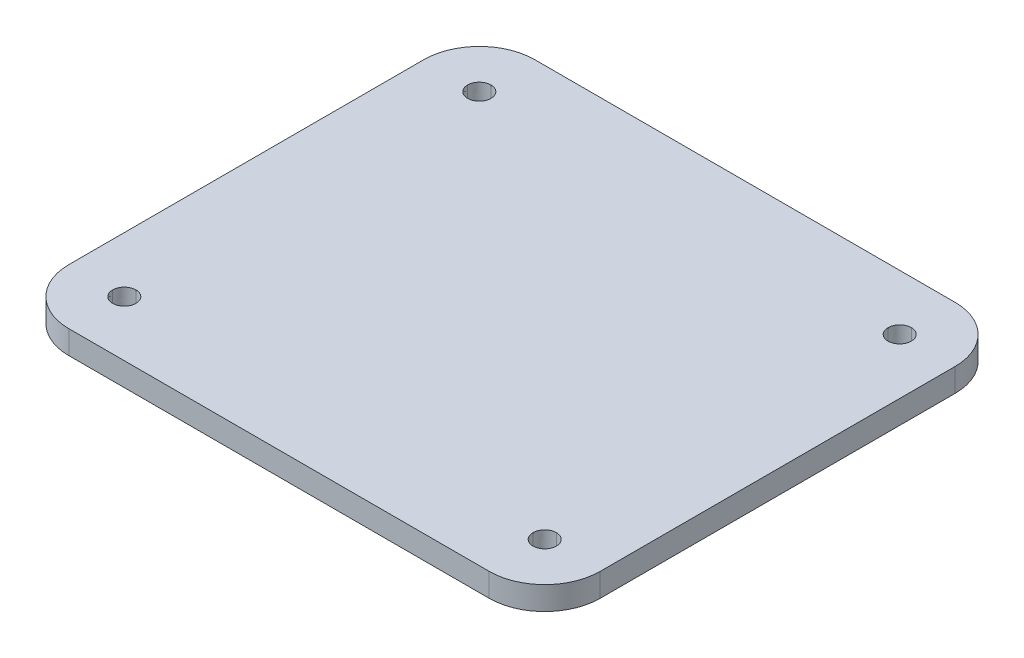
ISO-10303-21;
HEADER;
FILE_DESCRIPTION(('STEP AP214'),'2;1');
FILE_NAME('part.step','',(''),(''),'','','');
FILE_SCHEMA(('AUTOMOTIVE_DESIGN { 1 0 10303 214 1 1 1 1 }'));
ENDSEC;
DATA;
#1=APPLICATION_CONTEXT('core data for automotive mechanical design processes');
#2=APPLICATION_PROTOCOL_DEFINITION('international standard','automotive_design',2000,#1);
#3=PRODUCT_CONTEXT('',#1,'mechanical');
#4=PRODUCT('Part','Part','',(#3));
#5=PRODUCT_RELATED_PRODUCT_CATEGORY('part','',(#4));
#6=PRODUCT_DEFINITION_FORMATION('','',#4);
#7=PRODUCT_DEFINITION_CONTEXT('part definition',#1,'design');
#8=PRODUCT_DEFINITION('design','',#6,#7);
#9=PRODUCT_DEFINITION_SHAPE('','',#8);
#10=(LENGTH_UNIT() NAMED_UNIT(*) SI_UNIT(.MILLI.,.METRE.));
#11=(NAMED_UNIT(*) PLANE_ANGLE_UNIT() SI_UNIT($,.RADIAN.));
#12=(NAMED_UNIT(*) SI_UNIT($,.STERADIAN.) SOLID_ANGLE_UNIT());
#13=UNCERTAINTY_MEASURE_WITH_UNIT(LENGTH_MEASURE(1.E-05),#10,'distance_accuracy_value','');
#14=(GEOMETRIC_REPRESENTATION_CONTEXT(3) GLOBAL_UNCERTAINTY_ASSIGNED_CONTEXT((#13)) GLOBAL_UNIT_ASSIGNED_CONTEXT((#10,
#11,#12)) REPRESENTATION_CONTEXT('',''));
#15=CARTESIAN_POINT('',(0.,0.,0.));
#16=DIRECTION('',(0.,0.,1.));
#17=DIRECTION('',(1.,0.,0.));
#18=AXIS2_PLACEMENT_3D('',#15,#16,#17);
#19=CARTESIAN_POINT('',(-92.0838,3.175,-79.8373));
#20=DIRECTION('',(0.,-1.,0.));
#21=DIRECTION('',(0.,0.,-1.));
#22=AXIS2_PLACEMENT_3D('',#19,#20,#21);
#23=CYLINDRICAL_SURFACE('',#22,7.54000000000001);
#24=CARTESIAN_POINT('',(-92.0838,0.,-79.8373));
#25=DIRECTION('',(0.,1.,0.));
#26=DIRECTION('',(0.,0.,1.));
#27=AXIS2_PLACEMENT_3D('',#24,#25,#26);
#28=CIRCLE('',#27,7.54000000000001);
#29=CARTESIAN_POINT('',(-92.0837999999999,0.,-72.2973));
#30=VERTEX_POINT('',#29);
#31=CARTESIAN_POINT('',(-99.6238,0.,-79.8373000000001));
#32=VERTEX_POINT('',#31);
#33=EDGE_CURVE('E356',#30,#32,#28,.F.);
#34=ORIENTED_EDGE('',*,*,#33,.F.);
#35=DIRECTION('',(0.,-1.,0.));
#36=VECTOR('',#35,1.);
#37=CARTESIAN_POINT('',(-92.0837999999999,3.175,-72.2973));
#38=LINE('',#37,#36);
#39=CARTESIAN_POINT('',(-92.0837999999999,3.175,-72.2973));
#40=VERTEX_POINT('',#39);
#41=EDGE_CURVE('E11',#40,#30,#38,.T.);
#42=ORIENTED_EDGE('',*,*,#41,.F.);
#43=CARTESIAN_POINT('',(-92.0838,3.175,-79.8373));
#44=DIRECTION('',(0.,1.,0.));
#45=DIRECTION('',(0.,0.,1.));
#46=AXIS2_PLACEMENT_3D('',#43,#44,#45);
#47=CIRCLE('',#46,7.54000000000001);
#48=CARTESIAN_POINT('',(-99.6238,3.175,-79.8373000000001));
#49=VERTEX_POINT('',#48);
#50=EDGE_CURVE('E512',#40,#49,#47,.F.);
#51=ORIENTED_EDGE('',*,*,#50,.T.);
#52=DIRECTION('',(0.,-1.,0.));
#53=VECTOR('',#52,1.);
#54=CARTESIAN_POINT('',(-99.6238,3.175,-79.8373000000001));
#55=LINE('',#54,#53);
#56=EDGE_CURVE('E54',#49,#32,#55,.T.);
#57=ORIENTED_EDGE('',*,*,#56,.T.);
#58=EDGE_LOOP('',(#34,#42,#51,#57));
#59=FACE_BOUND('',#58,.T.);
#60=ADVANCED_FACE('F34',(#59),#23,.T.);
#61=CARTESIAN_POINT('',(0.,3.175,-72.2973));
#62=DIRECTION('',(0.,0.,-1.));
#63=DIRECTION('',(-1.,0.,0.));
#64=AXIS2_PLACEMENT_3D('',#61,#62,#63);
#65=PLANE('',#64);
#66=DIRECTION('',(1.,0.,0.));
#67=VECTOR('',#66,1.);
#68=CARTESIAN_POINT('',(0.,0.,-72.2973));
#69=LINE('',#68,#67);
#70=CARTESIAN_POINT('',(-34.9338,0.,-72.2973));
#71=VERTEX_POINT('',#70);
#72=EDGE_CURVE('E361',#30,#71,#69,.T.);
#73=ORIENTED_EDGE('',*,*,#72,.T.);
#74=DIRECTION('',(0.,-1.,0.));
#75=VECTOR('',#74,1.);
#76=CARTESIAN_POINT('',(-34.9338,3.175,-72.2973));
#77=LINE('',#76,#75);
#78=CARTESIAN_POINT('',(-34.9338,3.175,-72.2973));
#79=VERTEX_POINT('',#78);
#80=EDGE_CURVE('E45',#79,#71,#77,.T.);
#81=ORIENTED_EDGE('',*,*,#80,.F.);
#82=DIRECTION('',(1.,0.,0.));
#83=VECTOR('',#82,1.);
#84=CARTESIAN_POINT('',(0.,3.175,-72.2973));
#85=LINE('',#84,#83);
#86=EDGE_CURVE('E522',#40,#79,#85,.T.);
#87=ORIENTED_EDGE('',*,*,#86,.F.);
#88=ORIENTED_EDGE('',*,*,#41,.T.);
#89=EDGE_LOOP('',(#73,#81,#87,#88));
#90=FACE_BOUND('',#89,.T.);
#91=ADVANCED_FACE('F488',(#90),#65,.F.);
#92=CARTESIAN_POINT('',(-34.9338,3.175,-79.8373));
#93=DIRECTION('',(0.,-1.,0.));
#94=DIRECTION('',(0.,0.,-1.));
#95=AXIS2_PLACEMENT_3D('',#92,#93,#94);
#96=CYLINDRICAL_SURFACE('',#95,7.54);
#97=CARTESIAN_POINT('',(-34.9338,0.,-79.8373));
#98=DIRECTION('',(0.,1.,0.));
#99=DIRECTION('',(0.,0.,1.));
#100=AXIS2_PLACEMENT_3D('',#97,#98,#99);
#101=CIRCLE('',#100,7.54);
#102=CARTESIAN_POINT('',(-27.3938,0.,-79.8373000000001));
#103=VERTEX_POINT('',#102);
#104=EDGE_CURVE('E364',#71,#103,#101,.T.);
#105=ORIENTED_EDGE('',*,*,#104,.T.);
#106=DIRECTION('',(0.,-1.,0.));
#107=VECTOR('',#106,1.);
#108=CARTESIAN_POINT('',(-27.3938,3.175,-79.8373000000001));
#109=LINE('',#108,#107);
#110=CARTESIAN_POINT('',(-27.3938,3.175,-79.8373000000001));
#111=VERTEX_POINT('',#110);
#112=EDGE_CURVE('E386',#111,#103,#109,.T.);
#113=ORIENTED_EDGE('',*,*,#112,.F.);
#114=CARTESIAN_POINT('',(-34.9338,3.175,-79.8373));
#115=DIRECTION('',(0.,1.,0.));
#116=DIRECTION('',(0.,0.,1.));
#117=AXIS2_PLACEMENT_3D('',#114,#115,#116);
#118=CIRCLE('',#117,7.54);
#119=EDGE_CURVE('E525',#79,#111,#118,.T.);
#120=ORIENTED_EDGE('',*,*,#119,.F.);
#121=ORIENTED_EDGE('',*,*,#80,.T.);
#122=EDGE_LOOP('',(#105,#113,#120,#121));
#123=FACE_BOUND('',#122,.T.);
#124=ADVANCED_FACE('F493',(#123),#96,.T.);
#125=CARTESIAN_POINT('',(-27.3937999999999,3.175,0.));
#126=DIRECTION('',(-1.,0.,0.));
#127=DIRECTION('',(0.,0.,1.));
#128=AXIS2_PLACEMENT_3D('',#125,#126,#127);
#129=PLANE('',#128);
#130=DIRECTION('',(0.,0.,-1.));
#131=VECTOR('',#130,1.);
#132=CARTESIAN_POINT('',(-27.3937999999999,0.,0.));
#133=LINE('',#132,#131);
#134=CARTESIAN_POINT('',(-27.3938,0.,-128.0973));
#135=VERTEX_POINT('',#134);
#136=EDGE_CURVE('E367',#103,#135,#133,.T.);
#137=ORIENTED_EDGE('',*,*,#136,.T.);
#138=DIRECTION('',(0.,-1.,0.));
#139=VECTOR('',#138,1.);
#140=CARTESIAN_POINT('',(-27.3938,3.175,-128.0973));
#141=LINE('',#140,#139);
#142=CARTESIAN_POINT('',(-27.3938,3.175,-128.0973));
#143=VERTEX_POINT('',#142);
#144=EDGE_CURVE('E384',#143,#135,#141,.T.);
#145=ORIENTED_EDGE('',*,*,#144,.F.);
#146=DIRECTION('',(0.,0.,-1.));
#147=VECTOR('',#146,1.);
#148=CARTESIAN_POINT('',(-27.3937999999999,3.175,0.));
#149=LINE('',#148,#147);
#150=EDGE_CURVE('E528',#111,#143,#149,.T.);
#151=ORIENTED_EDGE('',*,*,#150,.F.);
#152=ORIENTED_EDGE('',*,*,#112,.T.);
#153=EDGE_LOOP('',(#137,#145,#151,#152));
#154=FACE_BOUND('',#153,.T.);
#155=ADVANCED_FACE('F550',(#154),#129,.F.);
#156=CARTESIAN_POINT('',(-34.9338,3.175,-128.0973));
#157=DIRECTION('',(0.,-1.,0.));
#158=DIRECTION('',(0.,0.,-1.));
#159=AXIS2_PLACEMENT_3D('',#156,#157,#158);
#160=CYLINDRICAL_SURFACE('',#159,7.53999999999999);
#161=CARTESIAN_POINT('',(-34.9338,0.,-128.0973));
#162=DIRECTION('',(0.,1.,0.));
#163=DIRECTION('',(0.,0.,1.));
#164=AXIS2_PLACEMENT_3D('',#161,#162,#163);
#165=CIRCLE('',#164,7.53999999999999);
#166=CARTESIAN_POINT('',(-34.9338,0.,-135.6373));
#167=VERTEX_POINT('',#166);
#168=EDGE_CURVE('E370',#167,#135,#165,.F.);
#169=ORIENTED_EDGE('',*,*,#168,.F.);
#170=DIRECTION('',(0.,-1.,0.));
#171=VECTOR('',#170,1.);
#172=CARTESIAN_POINT('',(-34.9338,3.175,-135.6373));
#173=LINE('',#172,#171);
#174=CARTESIAN_POINT('',(-34.9338,3.175,-135.6373));
#175=VERTEX_POINT('',#174);
#176=EDGE_CURVE('E212',#175,#167,#173,.T.);
#177=ORIENTED_EDGE('',*,*,#176,.F.);
#178=CARTESIAN_POINT('',(-34.9338,3.175,-128.0973));
#179=DIRECTION('',(0.,1.,0.));
#180=DIRECTION('',(0.,0.,1.));
#181=AXIS2_PLACEMENT_3D('',#178,#179,#180);
#182=CIRCLE('',#181,7.53999999999999);
#183=EDGE_CURVE('E222',#175,#143,#182,.F.);
#184=ORIENTED_EDGE('',*,*,#183,.T.);
#185=ORIENTED_EDGE('',*,*,#144,.T.);
#186=EDGE_LOOP('',(#169,#177,#184,#185));
#187=FACE_BOUND('',#186,.T.);
#188=ADVANCED_FACE('F531',(#187),#160,.T.);
#189=CARTESIAN_POINT('',(0.,3.175,-135.6373));
#190=DIRECTION('',(0.,0.,-1.));
#191=DIRECTION('',(-1.,0.,0.));
#192=AXIS2_PLACEMENT_3D('',#189,#190,#191);
#193=PLANE('',#192);
#194=DIRECTION('',(1.,0.,0.));
#195=VECTOR('',#194,1.);
#196=CARTESIAN_POINT('',(0.,0.,-135.6373));
#197=LINE('',#196,#195);
#198=CARTESIAN_POINT('',(-92.0838,0.,-135.6373));
#199=VERTEX_POINT('',#198);
#200=EDGE_CURVE('E208',#199,#167,#197,.T.);
#201=ORIENTED_EDGE('',*,*,#200,.F.);
#202=DIRECTION('',(0.,-1.,0.));
#203=VECTOR('',#202,1.);
#204=CARTESIAN_POINT('',(-92.0838,3.175,-135.6373));
#205=LINE('',#204,#203);
#206=CARTESIAN_POINT('',(-92.0838,3.175,-135.6373));
#207=VERTEX_POINT('',#206);
#208=EDGE_CURVE('E203',#207,#199,#205,.T.);
#209=ORIENTED_EDGE('',*,*,#208,.F.);
#210=DIRECTION('',(1.,0.,0.));
#211=VECTOR('',#210,1.);
#212=CARTESIAN_POINT('',(0.,3.175,-135.6373));
#213=LINE('',#212,#211);
#214=EDGE_CURVE('E206',#207,#175,#213,.T.);
#215=ORIENTED_EDGE('',*,*,#214,.T.);
#216=ORIENTED_EDGE('',*,*,#176,.T.);
#217=EDGE_LOOP('',(#201,#209,#215,#216));
#218=FACE_BOUND('',#217,.T.);
#219=ADVANCED_FACE('F205',(#218),#193,.T.);
#220=CARTESIAN_POINT('',(-92.0838,3.175,-128.0973));
#221=DIRECTION('',(0.,-1.,0.));
#222=DIRECTION('',(0.,0.,-1.));
#223=AXIS2_PLACEMENT_3D('',#220,#221,#222);
#224=CYLINDRICAL_SURFACE('',#223,7.54);
#225=CARTESIAN_POINT('',(-92.0838,0.,-128.0973));
#226=DIRECTION('',(0.,1.,0.));
#227=DIRECTION('',(0.,0.,1.));
#228=AXIS2_PLACEMENT_3D('',#225,#226,#227);
#229=CIRCLE('',#228,7.54);
#230=CARTESIAN_POINT('',(-99.6238,0.,-128.0973));
#231=VERTEX_POINT('',#230);
#232=EDGE_CURVE('E374',#231,#199,#229,.F.);
#233=ORIENTED_EDGE('',*,*,#232,.F.);
#234=DIRECTION('',(0.,-1.,0.));
#235=VECTOR('',#234,1.);
#236=CARTESIAN_POINT('',(-99.6238,3.175,-128.0973));
#237=LINE('',#236,#235);
#238=CARTESIAN_POINT('',(-99.6238,3.175,-128.0973));
#239=VERTEX_POINT('',#238);
#240=EDGE_CURVE('E127',#239,#231,#237,.T.);
#241=ORIENTED_EDGE('',*,*,#240,.F.);
#242=CARTESIAN_POINT('',(-92.0838,3.175,-128.0973));
#243=DIRECTION('',(0.,1.,0.));
#244=DIRECTION('',(0.,0.,1.));
#245=AXIS2_PLACEMENT_3D('',#242,#243,#244);
#246=CIRCLE('',#245,7.54);
#247=EDGE_CURVE('E220',#239,#207,#246,.F.);
#248=ORIENTED_EDGE('',*,*,#247,.T.);
#249=ORIENTED_EDGE('',*,*,#208,.T.);
#250=EDGE_LOOP('',(#233,#241,#248,#249));
#251=FACE_BOUND('',#250,.T.);
#252=ADVANCED_FACE('F224',(#251),#224,.T.);
#253=CARTESIAN_POINT('',(-34.9338,3.175,-78.2498));
#254=CARTESIAN_POINT('',(-34.057,3.175,-78.2498));
#255=CARTESIAN_POINT('',(-33.3463,3.175,-78.9605));
#256=CARTESIAN_POINT('',(-33.3463,3.175,-79.8373));
#257=B_SPLINE_CURVE_WITH_KNOTS('',3,(#253,#254,#255,#256),.UNSPECIFIED.,.F.,.F.,(4,4),(0.6,1.),.UNSPECIFIED.);
#258=DIRECTION('',(0.,-1.,0.));
#259=VECTOR('',#258,1.);
#260=SURFACE_OF_LINEAR_EXTRUSION('',#257,#259);
#261=CARTESIAN_POINT('',(-34.9338,0.,-78.2498));
#262=CARTESIAN_POINT('',(-34.057,0.,-78.2498));
#263=CARTESIAN_POINT('',(-33.3463,0.,-78.9605));
#264=CARTESIAN_POINT('',(-33.3463,0.,-79.8373));
#265=B_SPLINE_CURVE_WITH_KNOTS('',3,(#261,#262,#263,#264),.UNSPECIFIED.,.F.,.F.,(4,4),(0.6,1.),.UNSPECIFIED.);
#266=CARTESIAN_POINT('',(-34.9338,0.,-78.2498));
#267=VERTEX_POINT('',#266);
#268=CARTESIAN_POINT('',(-33.3462999999999,0.,-79.8373));
#269=VERTEX_POINT('',#268);
#270=EDGE_CURVE('E324',#267,#269,#265,.T.);
#271=ORIENTED_EDGE('',*,*,#270,.F.);
#272=DIRECTION('',(0.,-1.,0.));
#273=VECTOR('',#272,1.);
#274=CARTESIAN_POINT('',(-34.9338,3.175,-78.2498));
#275=LINE('',#274,#273);
#276=CARTESIAN_POINT('',(-34.9338,3.175,-78.2498));
#277=VERTEX_POINT('',#276);
#278=EDGE_CURVE('E381',#277,#267,#275,.T.);
#279=ORIENTED_EDGE('',*,*,#278,.F.);
#280=CARTESIAN_POINT('',(-33.3462999999999,3.175,-79.8373));
#281=VERTEX_POINT('',#280);
#282=EDGE_CURVE('E752',#277,#281,#257,.T.);
#283=ORIENTED_EDGE('',*,*,#282,.T.);
#284=DIRECTION('',(0.,-1.,0.));
#285=VECTOR('',#284,1.);
#286=CARTESIAN_POINT('',(-33.3462999999999,3.175,-79.8373));
#287=LINE('',#286,#285);
#288=EDGE_CURVE('E391',#281,#269,#287,.T.);
#289=ORIENTED_EDGE('',*,*,#288,.T.);
#290=EDGE_LOOP('',(#271,#279,#283,#289));
#291=FACE_BOUND('',#290,.T.);
#292=ADVANCED_FACE('F545',(#291),#260,.T.);
#293=CARTESIAN_POINT('',(-36.5213,3.175,-79.8373));
#294=CARTESIAN_POINT('',(-36.5213,3.175,-78.9605));
#295=CARTESIAN_POINT('',(-35.8106,3.175,-78.2498));
#296=CARTESIAN_POINT('',(-34.9338,3.175,-78.2498));
#297=B_SPLINE_CURVE_WITH_KNOTS('',3,(#293,#294,#295,#296),.UNSPECIFIED.,.F.,.F.,(4,4),(0.4,0.6),.UNSPECIFIED.);
#298=DIRECTION('',(0.,-1.,0.));
#299=VECTOR('',#298,1.);
#300=SURFACE_OF_LINEAR_EXTRUSION('',#297,#299);
#301=CARTESIAN_POINT('',(-36.5213,0.,-79.8373));
#302=CARTESIAN_POINT('',(-36.5213,0.,-78.9605));
#303=CARTESIAN_POINT('',(-35.8106,0.,-78.2498));
#304=CARTESIAN_POINT('',(-34.9338,0.,-78.2498));
#305=B_SPLINE_CURVE_WITH_KNOTS('',3,(#301,#302,#303,#304),.UNSPECIFIED.,.F.,.F.,(4,4),(0.4,0.6),.UNSPECIFIED.);
#306=CARTESIAN_POINT('',(-36.5213,0.,-79.8373));
#307=VERTEX_POINT('',#306);
#308=EDGE_CURVE('E332',#307,#267,#305,.T.);
#309=ORIENTED_EDGE('',*,*,#308,.F.);
#310=DIRECTION('',(0.,-1.,0.));
#311=VECTOR('',#310,1.);
#312=CARTESIAN_POINT('',(-36.5213,3.175,-79.8373));
#313=LINE('',#312,#311);
#314=CARTESIAN_POINT('',(-36.5213,3.175,-79.8373));
#315=VERTEX_POINT('',#314);
#316=EDGE_CURVE('E396',#315,#307,#313,.T.);
#317=ORIENTED_EDGE('',*,*,#316,.F.);
#318=EDGE_CURVE('E760',#315,#277,#297,.T.);
#319=ORIENTED_EDGE('',*,*,#318,.T.);
#320=ORIENTED_EDGE('',*,*,#278,.T.);
#321=EDGE_LOOP('',(#309,#317,#319,#320));
#322=FACE_BOUND('',#321,.T.);
#323=ADVANCED_FACE('F584',(#322),#300,.T.);
#324=CARTESIAN_POINT('',(-34.9338,3.175,-81.4248));
#325=CARTESIAN_POINT('',(-35.8106,3.175,-81.4248));
#326=CARTESIAN_POINT('',(-36.5213,3.175,-80.7141));
#327=CARTESIAN_POINT('',(-36.5213,3.175,-79.8373));
#328=B_SPLINE_CURVE_WITH_KNOTS('',3,(#324,#325,#326,#327),.UNSPECIFIED.,.F.,.F.,(4,4),(0.2,0.4),.UNSPECIFIED.);
#329=DIRECTION('',(0.,-1.,0.));
#330=VECTOR('',#329,1.);
#331=SURFACE_OF_LINEAR_EXTRUSION('',#328,#330);
#332=CARTESIAN_POINT('',(-34.9338,0.,-81.4248));
#333=CARTESIAN_POINT('',(-35.8106,0.,-81.4248));
#334=CARTESIAN_POINT('',(-36.5213,0.,-80.7141));
#335=CARTESIAN_POINT('',(-36.5213,0.,-79.8373));
#336=B_SPLINE_CURVE_WITH_KNOTS('',3,(#332,#333,#334,#335),.UNSPECIFIED.,.F.,.F.,(4,4),(0.2,0.4),.UNSPECIFIED.);
#337=CARTESIAN_POINT('',(-34.9338,0.,-81.4248));
#338=VERTEX_POINT('',#337);
#339=EDGE_CURVE('E340',#338,#307,#336,.T.);
#340=ORIENTED_EDGE('',*,*,#339,.F.);
#341=DIRECTION('',(0.,-1.,0.));
#342=VECTOR('',#341,1.);
#343=CARTESIAN_POINT('',(-34.9338,3.175,-81.4248));
#344=LINE('',#343,#342);
#345=CARTESIAN_POINT('',(-34.9338,3.175,-81.4248));
#346=VERTEX_POINT('',#345);
#347=EDGE_CURVE('E393',#346,#338,#344,.T.);
#348=ORIENTED_EDGE('',*,*,#347,.F.);
#349=EDGE_CURVE('E513',#346,#315,#328,.T.);
#350=ORIENTED_EDGE('',*,*,#349,.T.);
#351=ORIENTED_EDGE('',*,*,#316,.T.);
#352=EDGE_LOOP('',(#340,#348,#350,#351));
#353=FACE_BOUND('',#352,.T.);
#354=ADVANCED_FACE('F503',(#353),#331,.T.);
#355=CARTESIAN_POINT('',(-34.9338,3.175,-126.5098));
#356=CARTESIAN_POINT('',(-34.057,3.175,-126.5098));
#357=CARTESIAN_POINT('',(-33.3463,3.175,-127.2205));
#358=CARTESIAN_POINT('',(-33.3463,3.175,-128.0973));
#359=B_SPLINE_CURVE_WITH_KNOTS('',3,(#355,#356,#357,#358),.UNSPECIFIED.,.F.,.F.,(4,4),(0.6,1.),.UNSPECIFIED.);
#360=DIRECTION('',(0.,-1.,0.));
#361=VECTOR('',#360,1.);
#362=SURFACE_OF_LINEAR_EXTRUSION('',#359,#361);
#363=CARTESIAN_POINT('',(-34.9338,0.,-126.5098));
#364=CARTESIAN_POINT('',(-34.057,0.,-126.5098));
#365=CARTESIAN_POINT('',(-33.3463,0.,-127.2205));
#366=CARTESIAN_POINT('',(-33.3463,0.,-128.0973));
#367=B_SPLINE_CURVE_WITH_KNOTS('',3,(#363,#364,#365,#366),.UNSPECIFIED.,.F.,.F.,(4,4),(0.6,1.),.UNSPECIFIED.);
#368=CARTESIAN_POINT('',(-34.9338,0.,-126.5098));
#369=VERTEX_POINT('',#368);
#370=CARTESIAN_POINT('',(-33.3463,0.,-128.0973));
#371=VERTEX_POINT('',#370);
#372=EDGE_CURVE('E292',#369,#371,#367,.T.);
#373=ORIENTED_EDGE('',*,*,#372,.F.);
#374=DIRECTION('',(0.,-1.,0.));
#375=VECTOR('',#374,1.);
#376=CARTESIAN_POINT('',(-34.9338,3.175,-126.5098));
#377=LINE('',#376,#375);
#378=CARTESIAN_POINT('',(-34.9338,3.175,-126.5098));
#379=VERTEX_POINT('',#378);
#380=EDGE_CURVE('E394',#379,#369,#377,.T.);
#381=ORIENTED_EDGE('',*,*,#380,.F.);
#382=CARTESIAN_POINT('',(-33.3463,3.175,-128.0973));
#383=VERTEX_POINT('',#382);
#384=EDGE_CURVE('E716',#379,#383,#359,.T.);
#385=ORIENTED_EDGE('',*,*,#384,.T.);
#386=DIRECTION('',(0.,-1.,0.));
#387=VECTOR('',#386,1.);
#388=CARTESIAN_POINT('',(-33.3463,3.175,-128.0973));
#389=LINE('',#388,#387);
#390=EDGE_CURVE('E399',#383,#371,#389,.T.);
#391=ORIENTED_EDGE('',*,*,#390,.T.);
#392=EDGE_LOOP('',(#373,#381,#385,#391));
#393=FACE_BOUND('',#392,.T.);
#394=ADVANCED_FACE('F598',(#393),#362,.T.);
#395=CARTESIAN_POINT('',(-36.5212999999999,3.175,-128.0973));
#396=CARTESIAN_POINT('',(-36.5213,3.175,-127.2205));
#397=CARTESIAN_POINT('',(-35.8106,3.175,-126.5098));
#398=CARTESIAN_POINT('',(-34.9338,3.175,-126.5098));
#399=B_SPLINE_CURVE_WITH_KNOTS('',3,(#395,#396,#397,#398),.UNSPECIFIED.,.F.,.F.,(4,4),(0.4,0.6),.UNSPECIFIED.);
#400=DIRECTION('',(0.,-1.,0.));
#401=VECTOR('',#400,1.);
#402=SURFACE_OF_LINEAR_EXTRUSION('',#399,#401);
#403=CARTESIAN_POINT('',(-36.5212999999999,0.,-128.0973));
#404=CARTESIAN_POINT('',(-36.5213,0.,-127.2205));
#405=CARTESIAN_POINT('',(-35.8106,0.,-126.5098));
#406=CARTESIAN_POINT('',(-34.9338,0.,-126.5098));
#407=B_SPLINE_CURVE_WITH_KNOTS('',3,(#403,#404,#405,#406),.UNSPECIFIED.,.F.,.F.,(4,4),(0.4,0.6),.UNSPECIFIED.);
#408=CARTESIAN_POINT('',(-36.5213,0.,-128.0973));
#409=VERTEX_POINT('',#408);
#410=EDGE_CURVE('E300',#409,#369,#407,.T.);
#411=ORIENTED_EDGE('',*,*,#410,.F.);
#412=DIRECTION('',(0.,-1.,0.));
#413=VECTOR('',#412,1.);
#414=CARTESIAN_POINT('',(-36.5213,3.175,-128.0973));
#415=LINE('',#414,#413);
#416=CARTESIAN_POINT('',(-36.5213,3.175,-128.0973));
#417=VERTEX_POINT('',#416);
#418=EDGE_CURVE('E404',#417,#409,#415,.T.);
#419=ORIENTED_EDGE('',*,*,#418,.F.);
#420=EDGE_CURVE('E729',#417,#379,#399,.T.);
#421=ORIENTED_EDGE('',*,*,#420,.T.);
#422=ORIENTED_EDGE('',*,*,#380,.T.);
#423=EDGE_LOOP('',(#411,#419,#421,#422));
#424=FACE_BOUND('',#423,.T.);
#425=ADVANCED_FACE('F605',(#424),#402,.T.);
#426=CARTESIAN_POINT('',(-34.9337999999999,3.175,-129.6848));
#427=CARTESIAN_POINT('',(-35.8105999999999,3.175,-129.6848));
#428=CARTESIAN_POINT('',(-36.5212999999999,3.175,-128.9741));
#429=CARTESIAN_POINT('',(-36.5212999999999,3.175,-128.0973));
#430=B_SPLINE_CURVE_WITH_KNOTS('',3,(#426,#427,#428,#429),.UNSPECIFIED.,.F.,.F.,(4,4),(0.2,0.4),.UNSPECIFIED.);
#431=DIRECTION('',(0.,-1.,0.));
#432=VECTOR('',#431,1.);
#433=SURFACE_OF_LINEAR_EXTRUSION('',#430,#432);
#434=CARTESIAN_POINT('',(-34.9337999999999,0.,-129.6848));
#435=CARTESIAN_POINT('',(-35.8105999999999,0.,-129.6848));
#436=CARTESIAN_POINT('',(-36.5212999999999,0.,-128.9741));
#437=CARTESIAN_POINT('',(-36.5212999999999,0.,-128.0973));
#438=B_SPLINE_CURVE_WITH_KNOTS('',3,(#434,#435,#436,#437),.UNSPECIFIED.,.F.,.F.,(4,4),(0.2,0.4),.UNSPECIFIED.);
#439=CARTESIAN_POINT('',(-34.9337999999999,0.,-129.6848));
#440=VERTEX_POINT('',#439);
#441=EDGE_CURVE('E308',#440,#409,#438,.T.);
#442=ORIENTED_EDGE('',*,*,#441,.F.);
#443=DIRECTION('',(0.,-1.,0.));
#444=VECTOR('',#443,1.);
#445=CARTESIAN_POINT('',(-34.9337999999999,3.175,-129.6848));
#446=LINE('',#445,#444);
#447=CARTESIAN_POINT('',(-34.9337999999999,3.175,-129.6848));
#448=VERTEX_POINT('',#447);
#449=EDGE_CURVE('E401',#448,#440,#446,.T.);
#450=ORIENTED_EDGE('',*,*,#449,.F.);
#451=EDGE_CURVE('E738',#448,#417,#430,.T.);
#452=ORIENTED_EDGE('',*,*,#451,.T.);
#453=ORIENTED_EDGE('',*,*,#418,.T.);
#454=EDGE_LOOP('',(#442,#450,#452,#453));
#455=FACE_BOUND('',#454,.T.);
#456=ADVANCED_FACE('F613',(#455),#433,.T.);
#457=CARTESIAN_POINT('',(-92.0838,3.175,-126.5098));
#458=CARTESIAN_POINT('',(-91.2069999999999,3.175,-126.5098));
#459=CARTESIAN_POINT('',(-90.4962999999999,3.175,-127.2205));
#460=CARTESIAN_POINT('',(-90.4963,3.175,-128.0973));
#461=B_SPLINE_CURVE_WITH_KNOTS('',3,(#457,#458,#459,#460),.UNSPECIFIED.,.F.,.F.,(4,4),(0.6,1.),.UNSPECIFIED.);
#462=DIRECTION('',(0.,-1.,0.));
#463=VECTOR('',#462,1.);
#464=SURFACE_OF_LINEAR_EXTRUSION('',#461,#463);
#465=CARTESIAN_POINT('',(-92.0838,0.,-126.5098));
#466=CARTESIAN_POINT('',(-91.2069999999999,0.,-126.5098));
#467=CARTESIAN_POINT('',(-90.4962999999999,0.,-127.2205));
#468=CARTESIAN_POINT('',(-90.4963,0.,-128.0973));
#469=B_SPLINE_CURVE_WITH_KNOTS('',3,(#465,#466,#467,#468),.UNSPECIFIED.,.F.,.F.,(4,4),(0.6,1.),.UNSPECIFIED.);
#470=CARTESIAN_POINT('',(-92.0838,0.,-126.5098));
#471=VERTEX_POINT('',#470);
#472=CARTESIAN_POINT('',(-90.4963,0.,-128.0973));
#473=VERTEX_POINT('',#472);
#474=EDGE_CURVE('E260',#471,#473,#469,.T.);
#475=ORIENTED_EDGE('',*,*,#474,.F.);
#476=DIRECTION('',(0.,-1.,0.));
#477=VECTOR('',#476,1.);
#478=CARTESIAN_POINT('',(-92.0838,3.175,-126.5098));
#479=LINE('',#478,#477);
#480=CARTESIAN_POINT('',(-92.0838,3.175,-126.5098));
#481=VERTEX_POINT('',#480);
#482=EDGE_CURVE('E402',#481,#471,#479,.T.);
#483=ORIENTED_EDGE('',*,*,#482,.F.);
#484=CARTESIAN_POINT('',(-90.4963,3.175,-128.0973));
#485=VERTEX_POINT('',#484);
#486=EDGE_CURVE('E441',#481,#485,#461,.T.);
#487=ORIENTED_EDGE('',*,*,#486,.T.);
#488=DIRECTION('',(0.,-1.,0.));
#489=VECTOR('',#488,1.);
#490=CARTESIAN_POINT('',(-90.4963,3.175,-128.0973));
#491=LINE('',#490,#489);
#492=EDGE_CURVE('E407',#485,#473,#491,.T.);
#493=ORIENTED_EDGE('',*,*,#492,.T.);
#494=EDGE_LOOP('',(#475,#483,#487,#493));
#495=FACE_BOUND('',#494,.T.);
#496=ADVANCED_FACE('F466',(#495),#464,.T.);
#497=CARTESIAN_POINT('',(-93.6713,3.175,-128.0973));
#498=CARTESIAN_POINT('',(-93.6713,3.175,-127.2205));
#499=CARTESIAN_POINT('',(-92.9606,3.175,-126.5098));
#500=CARTESIAN_POINT('',(-92.0838,3.175,-126.5098));
#501=B_SPLINE_CURVE_WITH_KNOTS('',3,(#497,#498,#499,#500),.UNSPECIFIED.,.F.,.F.,(4,4),(0.4,0.6),.UNSPECIFIED.);
#502=DIRECTION('',(0.,-1.,0.));
#503=VECTOR('',#502,1.);
#504=SURFACE_OF_LINEAR_EXTRUSION('',#501,#503);
#505=CARTESIAN_POINT('',(-93.6713,0.,-128.0973));
#506=CARTESIAN_POINT('',(-93.6713,0.,-127.2205));
#507=CARTESIAN_POINT('',(-92.9606,0.,-126.5098));
#508=CARTESIAN_POINT('',(-92.0838,0.,-126.5098));
#509=B_SPLINE_CURVE_WITH_KNOTS('',3,(#505,#506,#507,#508),.UNSPECIFIED.,.F.,.F.,(4,4),(0.4,0.6),.UNSPECIFIED.);
#510=CARTESIAN_POINT('',(-93.6713,0.,-128.0973));
#511=VERTEX_POINT('',#510);
#512=EDGE_CURVE('E268',#511,#471,#509,.T.);
#513=ORIENTED_EDGE('',*,*,#512,.F.);
#514=DIRECTION('',(0.,-1.,0.));
#515=VECTOR('',#514,1.);
#516=CARTESIAN_POINT('',(-93.6713,3.175,-128.0973));
#517=LINE('',#516,#515);
#518=CARTESIAN_POINT('',(-93.6713,3.175,-128.0973));
#519=VERTEX_POINT('',#518);
#520=EDGE_CURVE('E411',#519,#511,#517,.T.);
#521=ORIENTED_EDGE('',*,*,#520,.F.);
#522=EDGE_CURVE('E444',#519,#481,#501,.T.);
#523=ORIENTED_EDGE('',*,*,#522,.T.);
#524=ORIENTED_EDGE('',*,*,#482,.T.);
#525=EDGE_LOOP('',(#513,#521,#523,#524));
#526=FACE_BOUND('',#525,.T.);
#527=ADVANCED_FACE('F628',(#526),#504,.T.);
#528=CARTESIAN_POINT('',(-92.0838,3.175,-129.6848));
#529=CARTESIAN_POINT('',(-92.9606,3.175,-129.6848));
#530=CARTESIAN_POINT('',(-93.6713,3.175,-128.9741));
#531=CARTESIAN_POINT('',(-93.6713,3.175,-128.0973));
#532=B_SPLINE_CURVE_WITH_KNOTS('',3,(#528,#529,#530,#531),.UNSPECIFIED.,.F.,.F.,(4,4),(0.2,0.4),.UNSPECIFIED.);
#533=DIRECTION('',(0.,-1.,0.));
#534=VECTOR('',#533,1.);
#535=SURFACE_OF_LINEAR_EXTRUSION('',#532,#534);
#536=CARTESIAN_POINT('',(-92.0838,0.,-129.6848));
#537=CARTESIAN_POINT('',(-92.9606,0.,-129.6848));
#538=CARTESIAN_POINT('',(-93.6713,0.,-128.9741));
#539=CARTESIAN_POINT('',(-93.6713,0.,-128.0973));
#540=B_SPLINE_CURVE_WITH_KNOTS('',3,(#536,#537,#538,#539),.UNSPECIFIED.,.F.,.F.,(4,4),(0.2,0.4),.UNSPECIFIED.);
#541=CARTESIAN_POINT('',(-92.0838,0.,-129.6848));
#542=VERTEX_POINT('',#541);
#543=EDGE_CURVE('E276',#542,#511,#540,.T.);
#544=ORIENTED_EDGE('',*,*,#543,.F.);
#545=DIRECTION('',(0.,-1.,0.));
#546=VECTOR('',#545,1.);
#547=CARTESIAN_POINT('',(-92.0838,3.175,-129.6848));
#548=LINE('',#547,#546);
#549=CARTESIAN_POINT('',(-92.0838,3.175,-129.6848));
#550=VERTEX_POINT('',#549);
#551=EDGE_CURVE('E409',#550,#542,#548,.T.);
#552=ORIENTED_EDGE('',*,*,#551,.F.);
#553=EDGE_CURVE('E717',#550,#519,#532,.T.);
#554=ORIENTED_EDGE('',*,*,#553,.T.);
#555=ORIENTED_EDGE('',*,*,#520,.T.);
#556=EDGE_LOOP('',(#544,#552,#554,#555));
#557=FACE_BOUND('',#556,.T.);
#558=ADVANCED_FACE('F486',(#557),#535,.T.);
#559=CARTESIAN_POINT('',(-92.0838,3.175,-78.2498));
#560=CARTESIAN_POINT('',(-91.207,3.175,-78.2498));
#561=CARTESIAN_POINT('',(-90.4963,3.175,-78.9605));
#562=CARTESIAN_POINT('',(-90.4963,3.175,-79.8373));
#563=B_SPLINE_CURVE_WITH_KNOTS('',3,(#559,#560,#561,#562),.UNSPECIFIED.,.F.,.F.,(4,4),(0.6,1.),.UNSPECIFIED.);
#564=DIRECTION('',(0.,-1.,0.));
#565=VECTOR('',#564,1.);
#566=SURFACE_OF_LINEAR_EXTRUSION('',#563,#565);
#567=CARTESIAN_POINT('',(-92.0838,0.,-78.2498));
#568=CARTESIAN_POINT('',(-91.207,0.,-78.2498));
#569=CARTESIAN_POINT('',(-90.4963,0.,-78.9605));
#570=CARTESIAN_POINT('',(-90.4963,0.,-79.8373));
#571=B_SPLINE_CURVE_WITH_KNOTS('',3,(#567,#568,#569,#570),.UNSPECIFIED.,.F.,.F.,(4,4),(0.6,1.),.UNSPECIFIED.);
#572=CARTESIAN_POINT('',(-92.0838,0.,-78.2498));
#573=VERTEX_POINT('',#572);
#574=CARTESIAN_POINT('',(-90.4963,0.,-79.8373));
#575=VERTEX_POINT('',#574);
#576=EDGE_CURVE('E231',#573,#575,#571,.T.);
#577=ORIENTED_EDGE('',*,*,#576,.F.);
#578=DIRECTION('',(0.,-1.,0.));
#579=VECTOR('',#578,1.);
#580=CARTESIAN_POINT('',(-92.0838,3.175,-78.2498));
#581=LINE('',#580,#579);
#582=CARTESIAN_POINT('',(-92.0838,3.175,-78.2498));
#583=VERTEX_POINT('',#582);
#584=EDGE_CURVE('E39',#583,#573,#581,.T.);
#585=ORIENTED_EDGE('',*,*,#584,.F.);
#586=CARTESIAN_POINT('',(-90.4963,3.175,-79.8373));
#587=VERTEX_POINT('',#586);
#588=EDGE_CURVE('E379',#583,#587,#563,.T.);
#589=ORIENTED_EDGE('',*,*,#588,.T.);
#590=DIRECTION('',(0.,-1.,0.));
#591=VECTOR('',#590,1.);
#592=CARTESIAN_POINT('',(-90.4963,3.175,-79.8373));
#593=LINE('',#592,#591);
#594=EDGE_CURVE('E227',#587,#575,#593,.T.);
#595=ORIENTED_EDGE('',*,*,#594,.T.);
#596=EDGE_LOOP('',(#577,#585,#589,#595));
#597=FACE_BOUND('',#596,.T.);
#598=ADVANCED_FACE('F36',(#597),#566,.T.);
#599=CARTESIAN_POINT('',(-93.6713,3.175,-79.8373));
#600=CARTESIAN_POINT('',(-93.6713,3.175,-78.9605));
#601=CARTESIAN_POINT('',(-92.9606,3.175,-78.2498));
#602=CARTESIAN_POINT('',(-92.0838,3.175,-78.2498));
#603=B_SPLINE_CURVE_WITH_KNOTS('',3,(#599,#600,#601,#602),.UNSPECIFIED.,.F.,.F.,(4,4),(0.4,0.6),.UNSPECIFIED.);
#604=DIRECTION('',(0.,-1.,0.));
#605=VECTOR('',#604,1.);
#606=SURFACE_OF_LINEAR_EXTRUSION('',#603,#605);
#607=CARTESIAN_POINT('',(-93.6713,0.,-79.8373));
#608=CARTESIAN_POINT('',(-93.6713,0.,-78.9605));
#609=CARTESIAN_POINT('',(-92.9606,0.,-78.2498));
#610=CARTESIAN_POINT('',(-92.0838,0.,-78.2498));
#611=B_SPLINE_CURVE_WITH_KNOTS('',3,(#607,#608,#609,#610),.UNSPECIFIED.,.F.,.F.,(4,4),(0.4,0.6),.UNSPECIFIED.);
#612=CARTESIAN_POINT('',(-93.6713,0.,-79.8373));
#613=VERTEX_POINT('',#612);
#614=EDGE_CURVE('E236',#613,#573,#611,.T.);
#615=ORIENTED_EDGE('',*,*,#614,.F.);
#616=DIRECTION('',(0.,-1.,0.));
#617=VECTOR('',#616,1.);
#618=CARTESIAN_POINT('',(-93.6713,3.175,-79.8373));
#619=LINE('',#618,#617);
#620=CARTESIAN_POINT('',(-93.6713,3.175,-79.8373));
#621=VERTEX_POINT('',#620);
#622=EDGE_CURVE('E416',#621,#613,#619,.T.);
#623=ORIENTED_EDGE('',*,*,#622,.F.);
#624=EDGE_CURVE('E425',#621,#583,#603,.T.);
#625=ORIENTED_EDGE('',*,*,#624,.T.);
#626=ORIENTED_EDGE('',*,*,#584,.T.);
#627=EDGE_LOOP('',(#615,#623,#625,#626));
#628=FACE_BOUND('',#627,.T.);
#629=ADVANCED_FACE('F423',(#628),#606,.T.);
#630=CARTESIAN_POINT('',(-92.0838,3.175,-81.4248));
#631=CARTESIAN_POINT('',(-92.9606,3.175,-81.4248));
#632=CARTESIAN_POINT('',(-93.6713,3.175,-80.7141));
#633=CARTESIAN_POINT('',(-93.6713,3.175,-79.8373));
#634=B_SPLINE_CURVE_WITH_KNOTS('',3,(#630,#631,#632,#633),.UNSPECIFIED.,.F.,.F.,(4,4),(0.2,0.4),.UNSPECIFIED.);
#635=DIRECTION('',(0.,-1.,0.));
#636=VECTOR('',#635,1.);
#637=SURFACE_OF_LINEAR_EXTRUSION('',#634,#636);
#638=CARTESIAN_POINT('',(-92.0838,0.,-81.4248));
#639=CARTESIAN_POINT('',(-92.9606,0.,-81.4248));
#640=CARTESIAN_POINT('',(-93.6713,0.,-80.7141));
#641=CARTESIAN_POINT('',(-93.6713,0.,-79.8373));
#642=B_SPLINE_CURVE_WITH_KNOTS('',3,(#638,#639,#640,#641),.UNSPECIFIED.,.F.,.F.,(4,4),(0.2,0.4),.UNSPECIFIED.);
#643=CARTESIAN_POINT('',(-92.0838,0.,-81.4248));
#644=VERTEX_POINT('',#643);
#645=EDGE_CURVE('E244',#644,#613,#642,.T.);
#646=ORIENTED_EDGE('',*,*,#645,.F.);
#647=DIRECTION('',(0.,-1.,0.));
#648=VECTOR('',#647,1.);
#649=CARTESIAN_POINT('',(-92.0838,3.175,-81.4248));
#650=LINE('',#649,#648);
#651=CARTESIAN_POINT('',(-92.0838,3.175,-81.4248));
#652=VERTEX_POINT('',#651);
#653=EDGE_CURVE('E415',#652,#644,#650,.T.);
#654=ORIENTED_EDGE('',*,*,#653,.F.);
#655=EDGE_CURVE('E432',#652,#621,#634,.T.);
#656=ORIENTED_EDGE('',*,*,#655,.T.);
#657=ORIENTED_EDGE('',*,*,#622,.T.);
#658=EDGE_LOOP('',(#646,#654,#656,#657));
#659=FACE_BOUND('',#658,.T.);
#660=ADVANCED_FACE('F430',(#659),#637,.T.);
#661=CARTESIAN_POINT('',(-33.3463,3.175,-79.8373));
#662=CARTESIAN_POINT('',(-33.3463,3.175,-80.7141));
#663=CARTESIAN_POINT('',(-34.057,3.175,-81.4248));
#664=CARTESIAN_POINT('',(-34.9338,3.175,-81.4248));
#665=B_SPLINE_CURVE_WITH_KNOTS('',3,(#661,#662,#663,#664),.UNSPECIFIED.,.F.,.F.,(4,4),(0.,0.2),.UNSPECIFIED.);
#666=DIRECTION('',(0.,-1.,0.));
#667=VECTOR('',#666,1.);
#668=SURFACE_OF_LINEAR_EXTRUSION('',#665,#667);
#669=CARTESIAN_POINT('',(-33.3463,0.,-79.8373));
#670=CARTESIAN_POINT('',(-33.3463,0.,-80.7141));
#671=CARTESIAN_POINT('',(-34.057,0.,-81.4248));
#672=CARTESIAN_POINT('',(-34.9338,0.,-81.4248));
#673=B_SPLINE_CURVE_WITH_KNOTS('',3,(#669,#670,#671,#672),.UNSPECIFIED.,.F.,.F.,(4,4),(0.,0.2),.UNSPECIFIED.);
#674=EDGE_CURVE('E348',#269,#338,#673,.T.);
#675=ORIENTED_EDGE('',*,*,#674,.F.);
#676=ORIENTED_EDGE('',*,*,#288,.F.);
#677=EDGE_CURVE('E506',#281,#346,#665,.T.);
#678=ORIENTED_EDGE('',*,*,#677,.T.);
#679=ORIENTED_EDGE('',*,*,#347,.T.);
#680=EDGE_LOOP('',(#675,#676,#678,#679));
#681=FACE_BOUND('',#680,.T.);
#682=ADVANCED_FACE('F469',(#681),#668,.T.);
#683=CARTESIAN_POINT('',(-33.3463,3.175,-128.0973));
#684=CARTESIAN_POINT('',(-33.3462999999999,3.175,-128.9741));
#685=CARTESIAN_POINT('',(-34.0569999999999,3.175,-129.6848));
#686=CARTESIAN_POINT('',(-34.9337999999999,3.175,-129.6848));
#687=B_SPLINE_CURVE_WITH_KNOTS('',3,(#683,#684,#685,#686),.UNSPECIFIED.,.F.,.F.,(4,4),(0.,0.2),.UNSPECIFIED.);
#688=DIRECTION('',(0.,-1.,0.));
#689=VECTOR('',#688,1.);
#690=SURFACE_OF_LINEAR_EXTRUSION('',#687,#689);
#691=CARTESIAN_POINT('',(-33.3463,0.,-128.0973));
#692=CARTESIAN_POINT('',(-33.3462999999999,0.,-128.9741));
#693=CARTESIAN_POINT('',(-34.0569999999999,0.,-129.6848));
#694=CARTESIAN_POINT('',(-34.9337999999999,0.,-129.6848));
#695=B_SPLINE_CURVE_WITH_KNOTS('',3,(#691,#692,#693,#694),.UNSPECIFIED.,.F.,.F.,(4,4),(0.,0.2),.UNSPECIFIED.);
#696=EDGE_CURVE('E316',#371,#440,#695,.T.);
#697=ORIENTED_EDGE('',*,*,#696,.F.);
#698=ORIENTED_EDGE('',*,*,#390,.F.);
#699=EDGE_CURVE('E747',#383,#448,#687,.T.);
#700=ORIENTED_EDGE('',*,*,#699,.T.);
#701=ORIENTED_EDGE('',*,*,#449,.T.);
#702=EDGE_LOOP('',(#697,#698,#700,#701));
#703=FACE_BOUND('',#702,.T.);
#704=ADVANCED_FACE('F501',(#703),#690,.T.);
#705=CARTESIAN_POINT('',(-90.4963,3.175,-128.0973));
#706=CARTESIAN_POINT('',(-90.4963,3.175,-128.9741));
#707=CARTESIAN_POINT('',(-91.2069999999999,3.175,-129.6848));
#708=CARTESIAN_POINT('',(-92.0838,3.175,-129.6848));
#709=B_SPLINE_CURVE_WITH_KNOTS('',3,(#705,#706,#707,#708),.UNSPECIFIED.,.F.,.F.,(4,4),(0.,0.2),.UNSPECIFIED.);
#710=DIRECTION('',(0.,-1.,0.));
#711=VECTOR('',#710,1.);
#712=SURFACE_OF_LINEAR_EXTRUSION('',#709,#711);
#713=CARTESIAN_POINT('',(-90.4963,0.,-128.0973));
#714=CARTESIAN_POINT('',(-90.4963,0.,-128.9741));
#715=CARTESIAN_POINT('',(-91.2069999999999,0.,-129.6848));
#716=CARTESIAN_POINT('',(-92.0838,0.,-129.6848));
#717=B_SPLINE_CURVE_WITH_KNOTS('',3,(#713,#714,#715,#716),.UNSPECIFIED.,.F.,.F.,(4,4),(0.,0.2),.UNSPECIFIED.);
#718=EDGE_CURVE('E284',#473,#542,#717,.T.);
#719=ORIENTED_EDGE('',*,*,#718,.F.);
#720=ORIENTED_EDGE('',*,*,#492,.F.);
#721=EDGE_CURVE('E711',#485,#550,#709,.T.);
#722=ORIENTED_EDGE('',*,*,#721,.T.);
#723=ORIENTED_EDGE('',*,*,#551,.T.);
#724=EDGE_LOOP('',(#719,#720,#722,#723));
#725=FACE_BOUND('',#724,.T.);
#726=ADVANCED_FACE('F465',(#725),#712,.T.);
#727=CARTESIAN_POINT('',(-90.4963,3.175,-79.8373));
#728=CARTESIAN_POINT('',(-90.4963,3.175,-80.7141));
#729=CARTESIAN_POINT('',(-91.207,3.175,-81.4248));
#730=CARTESIAN_POINT('',(-92.0838,3.175,-81.4248));
#731=B_SPLINE_CURVE_WITH_KNOTS('',3,(#727,#728,#729,#730),.UNSPECIFIED.,.F.,.F.,(4,4),(0.,0.2),.UNSPECIFIED.);
#732=DIRECTION('',(0.,-1.,0.));
#733=VECTOR('',#732,1.);
#734=SURFACE_OF_LINEAR_EXTRUSION('',#731,#733);
#735=CARTESIAN_POINT('',(-90.4963,0.,-79.8373));
#736=CARTESIAN_POINT('',(-90.4963,0.,-80.7141));
#737=CARTESIAN_POINT('',(-91.207,0.,-81.4248));
#738=CARTESIAN_POINT('',(-92.0838,0.,-81.4248));
#739=B_SPLINE_CURVE_WITH_KNOTS('',3,(#735,#736,#737,#738),.UNSPECIFIED.,.F.,.F.,(4,4),(0.,0.2),.UNSPECIFIED.);
#740=EDGE_CURVE('E252',#575,#644,#739,.T.);
#741=ORIENTED_EDGE('',*,*,#740,.F.);
#742=ORIENTED_EDGE('',*,*,#594,.F.);
#743=EDGE_CURVE('E438',#587,#652,#731,.T.);
#744=ORIENTED_EDGE('',*,*,#743,.T.);
#745=ORIENTED_EDGE('',*,*,#653,.T.);
#746=EDGE_LOOP('',(#741,#742,#744,#745));
#747=FACE_BOUND('',#746,.T.);
#748=ADVANCED_FACE('F440',(#747),#734,.T.);
#749=CARTESIAN_POINT('',(-99.6237999999999,3.175,0.));
#750=DIRECTION('',(-1.,0.,0.));
#751=DIRECTION('',(0.,0.,1.));
#752=AXIS2_PLACEMENT_3D('',#749,#750,#751);
#753=PLANE('',#752);
#754=DIRECTION('',(0.,0.,-1.));
#755=VECTOR('',#754,1.);
#756=CARTESIAN_POINT('',(-99.6237999999999,0.,0.));
#757=LINE('',#756,#755);
#758=EDGE_CURVE('E376',#32,#231,#757,.T.);
#759=ORIENTED_EDGE('',*,*,#758,.F.);
#760=ORIENTED_EDGE('',*,*,#56,.F.);
#761=DIRECTION('',(0.,0.,-1.));
#762=VECTOR('',#761,1.);
#763=CARTESIAN_POINT('',(-99.6237999999999,3.175,0.));
#764=LINE('',#763,#762);
#765=EDGE_CURVE('E225',#49,#239,#764,.T.);
#766=ORIENTED_EDGE('',*,*,#765,.T.);
#767=ORIENTED_EDGE('',*,*,#240,.T.);
#768=EDGE_LOOP('',(#759,#760,#766,#767));
#769=FACE_BOUND('',#768,.T.);
#770=ADVANCED_FACE('F464',(#769),#753,.T.);
#771=CARTESIAN_POINT('',(0.,3.175,0.));
#772=DIRECTION('',(0.,1.,0.));
#773=DIRECTION('',(0.,0.,1.));
#774=AXIS2_PLACEMENT_3D('',#771,#772,#773);
#775=PLANE('',#774);
#776=ORIENTED_EDGE('',*,*,#588,.F.);
#777=ORIENTED_EDGE('',*,*,#624,.F.);
#778=ORIENTED_EDGE('',*,*,#655,.F.);
#779=ORIENTED_EDGE('',*,*,#743,.F.);
#780=EDGE_LOOP('',(#776,#777,#778,#779));
#781=FACE_BOUND('',#780,.T.);
#782=ORIENTED_EDGE('',*,*,#486,.F.);
#783=ORIENTED_EDGE('',*,*,#522,.F.);
#784=ORIENTED_EDGE('',*,*,#553,.F.);
#785=ORIENTED_EDGE('',*,*,#721,.F.);
#786=EDGE_LOOP('',(#782,#783,#784,#785));
#787=FACE_BOUND('',#786,.T.);
#788=ORIENTED_EDGE('',*,*,#384,.F.);
#789=ORIENTED_EDGE('',*,*,#420,.F.);
#790=ORIENTED_EDGE('',*,*,#451,.F.);
#791=ORIENTED_EDGE('',*,*,#699,.F.);
#792=EDGE_LOOP('',(#788,#789,#790,#791));
#793=FACE_BOUND('',#792,.T.);
#794=ORIENTED_EDGE('',*,*,#282,.F.);
#795=ORIENTED_EDGE('',*,*,#318,.F.);
#796=ORIENTED_EDGE('',*,*,#349,.F.);
#797=ORIENTED_EDGE('',*,*,#677,.F.);
#798=EDGE_LOOP('',(#794,#795,#796,#797));
#799=FACE_BOUND('',#798,.T.);
#800=ORIENTED_EDGE('',*,*,#50,.F.);
#801=ORIENTED_EDGE('',*,*,#86,.T.);
#802=ORIENTED_EDGE('',*,*,#119,.T.);
#803=ORIENTED_EDGE('',*,*,#150,.T.);
#804=ORIENTED_EDGE('',*,*,#183,.F.);
#805=ORIENTED_EDGE('',*,*,#214,.F.);
#806=ORIENTED_EDGE('',*,*,#247,.F.);
#807=ORIENTED_EDGE('',*,*,#765,.F.);
#808=EDGE_LOOP('',(#800,#801,#802,#803,#804,#805,#806,#807));
#809=FACE_BOUND('',#808,.T.);
#810=ADVANCED_FACE('F218',(#781,#787,#793,#799,#809),#775,.T.);
#811=CARTESIAN_POINT('',(0.,0.,0.));
#812=DIRECTION('',(0.,1.,0.));
#813=DIRECTION('',(0.,0.,1.));
#814=AXIS2_PLACEMENT_3D('',#811,#812,#813);
#815=PLANE('',#814);
#816=ORIENTED_EDGE('',*,*,#576,.T.);
#817=ORIENTED_EDGE('',*,*,#740,.T.);
#818=ORIENTED_EDGE('',*,*,#645,.T.);
#819=ORIENTED_EDGE('',*,*,#614,.T.);
#820=EDGE_LOOP('',(#816,#817,#818,#819));
#821=FACE_BOUND('',#820,.T.);
#822=ORIENTED_EDGE('',*,*,#474,.T.);
#823=ORIENTED_EDGE('',*,*,#718,.T.);
#824=ORIENTED_EDGE('',*,*,#543,.T.);
#825=ORIENTED_EDGE('',*,*,#512,.T.);
#826=EDGE_LOOP('',(#822,#823,#824,#825));
#827=FACE_BOUND('',#826,.T.);
#828=ORIENTED_EDGE('',*,*,#372,.T.);
#829=ORIENTED_EDGE('',*,*,#696,.T.);
#830=ORIENTED_EDGE('',*,*,#441,.T.);
#831=ORIENTED_EDGE('',*,*,#410,.T.);
#832=EDGE_LOOP('',(#828,#829,#830,#831));
#833=FACE_BOUND('',#832,.T.);
#834=ORIENTED_EDGE('',*,*,#270,.T.);
#835=ORIENTED_EDGE('',*,*,#674,.T.);
#836=ORIENTED_EDGE('',*,*,#339,.T.);
#837=ORIENTED_EDGE('',*,*,#308,.T.);
#838=EDGE_LOOP('',(#834,#835,#836,#837));
#839=FACE_BOUND('',#838,.T.);
#840=ORIENTED_EDGE('',*,*,#33,.T.);
#841=ORIENTED_EDGE('',*,*,#758,.T.);
#842=ORIENTED_EDGE('',*,*,#232,.T.);
#843=ORIENTED_EDGE('',*,*,#200,.T.);
#844=ORIENTED_EDGE('',*,*,#168,.T.);
#845=ORIENTED_EDGE('',*,*,#136,.F.);
#846=ORIENTED_EDGE('',*,*,#104,.F.);
#847=ORIENTED_EDGE('',*,*,#72,.F.);
#848=EDGE_LOOP('',(#840,#841,#842,#843,#844,#845,#846,#847));
#849=FACE_BOUND('',#848,.T.);
#850=ADVANCED_FACE('F428',(#821,#827,#833,#839,#849),#815,.F.);
#851=CLOSED_SHELL('',(#60,#91,#124,#155,#188,#219,#252,#292,#323,#354,#394,#425,#456,#496,#527,
#558,#598,#629,#660,#682,#704,#726,#748,#770,#810,#850));
#852=MANIFOLD_SOLID_BREP('B2',#851);
#853=ADVANCED_BREP_SHAPE_REPRESENTATION('',(#18,#852),#14);
#854=SHAPE_DEFINITION_REPRESENTATION(#9,#853);
ENDSEC;
END-ISO-10303-21;
